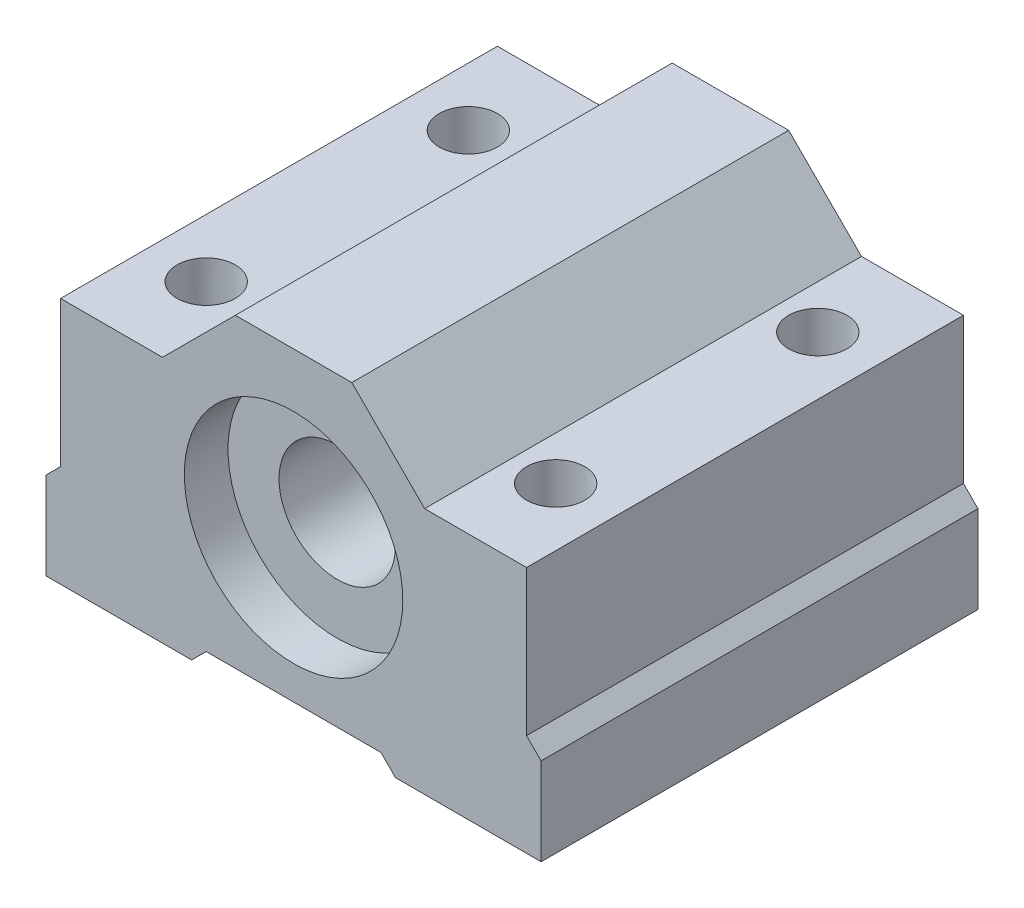
ISO-10303-21;
HEADER;
FILE_DESCRIPTION(('STEP AP214'),'2;1');
FILE_NAME('part.step','',(''),(''),'','','');
FILE_SCHEMA(('AUTOMOTIVE_DESIGN { 1 0 10303 214 1 1 1 1 }'));
ENDSEC;
DATA;
#1=APPLICATION_CONTEXT('core data for automotive mechanical design processes');
#2=APPLICATION_PROTOCOL_DEFINITION('international standard','automotive_design',2000,#1);
#3=PRODUCT_CONTEXT('',#1,'mechanical');
#4=PRODUCT('Part','Part','',(#3));
#5=PRODUCT_RELATED_PRODUCT_CATEGORY('part','',(#4));
#6=PRODUCT_DEFINITION_FORMATION('','',#4);
#7=PRODUCT_DEFINITION_CONTEXT('part definition',#1,'design');
#8=PRODUCT_DEFINITION('design','',#6,#7);
#9=PRODUCT_DEFINITION_SHAPE('','',#8);
#10=(LENGTH_UNIT() NAMED_UNIT(*) SI_UNIT(.MILLI.,.METRE.));
#11=(NAMED_UNIT(*) PLANE_ANGLE_UNIT() SI_UNIT($,.RADIAN.));
#12=(NAMED_UNIT(*) SI_UNIT($,.STERADIAN.) SOLID_ANGLE_UNIT());
#13=UNCERTAINTY_MEASURE_WITH_UNIT(LENGTH_MEASURE(1.E-05),#10,'distance_accuracy_value','');
#14=(GEOMETRIC_REPRESENTATION_CONTEXT(3) GLOBAL_UNCERTAINTY_ASSIGNED_CONTEXT((#13)) GLOBAL_UNIT_ASSIGNED_CONTEXT((#10,
#11,#12)) REPRESENTATION_CONTEXT('',''));
#15=CARTESIAN_POINT('',(0.,0.,0.));
#16=DIRECTION('',(0.,0.,1.));
#17=DIRECTION('',(1.,0.,0.));
#18=AXIS2_PLACEMENT_3D('',#15,#16,#17);
#19=CARTESIAN_POINT('',(-1.89319855181285,-1.89319855181285,-15.));
#20=DIRECTION('',(-0.707106781186548,-0.707106781186547,0.));
#21=DIRECTION('',(0.707106781186547,-0.707106781186548,0.));
#22=AXIS2_PLACEMENT_3D('',#19,#20,#21);
#23=PLANE('',#22);
#24=DIRECTION('',(0.,0.,1.));
#25=VECTOR('',#24,1.);
#26=CARTESIAN_POINT('',(7.,-10.7863971036257,-15.));
#27=LINE('',#26,#25);
#28=CARTESIAN_POINT('',(7.,-10.7863971036257,-15.));
#29=VERTEX_POINT('',#28);
#30=CARTESIAN_POINT('',(7.,-10.7863971036257,15.));
#31=VERTEX_POINT('',#30);
#32=EDGE_CURVE('E182',#29,#31,#27,.T.);
#33=ORIENTED_EDGE('',*,*,#32,.T.);
#34=DIRECTION('',(0.707106781186547,-0.707106781186548,0.));
#35=VECTOR('',#34,1.);
#36=CARTESIAN_POINT('',(-1.89319855181285,-1.89319855181285,15.));
#37=LINE('',#36,#35);
#38=CARTESIAN_POINT('',(6.,-9.78639710362571,15.));
#39=VERTEX_POINT('',#38);
#40=EDGE_CURVE('E185',#39,#31,#37,.T.);
#41=ORIENTED_EDGE('',*,*,#40,.F.);
#42=DIRECTION('',(0.,0.,1.));
#43=VECTOR('',#42,1.);
#44=CARTESIAN_POINT('',(6.,-9.78639710362571,-15.));
#45=LINE('',#44,#43);
#46=CARTESIAN_POINT('',(6.,-9.78639710362571,-15.));
#47=VERTEX_POINT('',#46);
#48=EDGE_CURVE('E11',#47,#39,#45,.T.);
#49=ORIENTED_EDGE('',*,*,#48,.F.);
#50=DIRECTION('',(0.707106781186547,-0.707106781186548,0.));
#51=VECTOR('',#50,1.);
#52=CARTESIAN_POINT('',(-1.89319855181285,-1.89319855181285,-15.));
#53=LINE('',#52,#51);
#54=EDGE_CURVE('E186',#47,#29,#53,.T.);
#55=ORIENTED_EDGE('',*,*,#54,.T.);
#56=EDGE_LOOP('',(#33,#41,#49,#55));
#57=FACE_BOUND('',#56,.T.);
#58=ADVANCED_FACE('F46',(#57),#23,.T.);
#59=CARTESIAN_POINT('',(0.,-9.78639710362571,-15.));
#60=DIRECTION('',(0.,-1.,0.));
#61=DIRECTION('',(0.,0.,-1.));
#62=AXIS2_PLACEMENT_3D('',#59,#60,#61);
#63=PLANE('',#62);
#64=ORIENTED_EDGE('',*,*,#48,.T.);
#65=DIRECTION('',(1.,0.,0.));
#66=VECTOR('',#65,1.);
#67=CARTESIAN_POINT('',(0.,-9.78639710362571,15.));
#68=LINE('',#67,#66);
#69=CARTESIAN_POINT('',(-6.,-9.78639710362571,15.));
#70=VERTEX_POINT('',#69);
#71=EDGE_CURVE('E206',#70,#39,#68,.T.);
#72=ORIENTED_EDGE('',*,*,#71,.F.);
#73=DIRECTION('',(0.,0.,1.));
#74=VECTOR('',#73,1.);
#75=CARTESIAN_POINT('',(-6.,-9.78639710362571,-15.));
#76=LINE('',#75,#74);
#77=CARTESIAN_POINT('',(-6.,-9.78639710362571,-15.));
#78=VERTEX_POINT('',#77);
#79=EDGE_CURVE('E55',#78,#70,#76,.T.);
#80=ORIENTED_EDGE('',*,*,#79,.F.);
#81=DIRECTION('',(1.,0.,0.));
#82=VECTOR('',#81,1.);
#83=CARTESIAN_POINT('',(0.,-9.78639710362571,-15.));
#84=LINE('',#83,#82);
#85=EDGE_CURVE('E192',#78,#47,#84,.T.);
#86=ORIENTED_EDGE('',*,*,#85,.T.);
#87=EDGE_LOOP('',(#64,#72,#80,#86));
#88=FACE_BOUND('',#87,.T.);
#89=ADVANCED_FACE('F414',(#88),#63,.T.);
#90=CARTESIAN_POINT('',(1.89319855181288,-1.8931985518129,-15.));
#91=DIRECTION('',(-0.707106781186544,0.707106781186551,0.));
#92=DIRECTION('',(-0.707106781186551,-0.707106781186544,0.));
#93=AXIS2_PLACEMENT_3D('',#90,#91,#92);
#94=PLANE('',#93);
#95=ORIENTED_EDGE('',*,*,#79,.T.);
#96=DIRECTION('',(-0.707106781186551,-0.707106781186544,0.));
#97=VECTOR('',#96,1.);
#98=CARTESIAN_POINT('',(1.89319855181288,-1.8931985518129,15.));
#99=LINE('',#98,#97);
#100=CARTESIAN_POINT('',(-7.00000000000001,-10.7863971036257,15.));
#101=VERTEX_POINT('',#100);
#102=EDGE_CURVE('E262',#70,#101,#99,.T.);
#103=ORIENTED_EDGE('',*,*,#102,.T.);
#104=DIRECTION('',(0.,0.,1.));
#105=VECTOR('',#104,1.);
#106=CARTESIAN_POINT('',(-7.00000000000001,-10.7863971036257,-15.));
#107=LINE('',#106,#105);
#108=CARTESIAN_POINT('',(-7.00000000000001,-10.7863971036257,-15.));
#109=VERTEX_POINT('',#108);
#110=EDGE_CURVE('E322',#109,#101,#107,.T.);
#111=ORIENTED_EDGE('',*,*,#110,.F.);
#112=DIRECTION('',(-0.707106781186551,-0.707106781186544,0.));
#113=VECTOR('',#112,1.);
#114=CARTESIAN_POINT('',(1.89319855181288,-1.8931985518129,-15.));
#115=LINE('',#114,#113);
#116=EDGE_CURVE('E315',#78,#109,#115,.T.);
#117=ORIENTED_EDGE('',*,*,#116,.F.);
#118=EDGE_LOOP('',(#95,#103,#111,#117));
#119=FACE_BOUND('',#118,.T.);
#120=ADVANCED_FACE('F418',(#119),#94,.F.);
#121=CARTESIAN_POINT('',(0.,-10.7863971036257,-15.));
#122=DIRECTION('',(0.,-1.,0.));
#123=DIRECTION('',(0.,0.,-1.));
#124=AXIS2_PLACEMENT_3D('',#121,#122,#123);
#125=PLANE('',#124);
#126=CARTESIAN_POINT('',(-12.,-10.7863971036257,8.99999999999999));
#127=DIRECTION('',(0.,-1.,0.));
#128=DIRECTION('',(0.,0.,1.));
#129=AXIS2_PLACEMENT_3D('',#126,#127,#128);
#130=CIRCLE('',#129,2.);
#131=CARTESIAN_POINT('',(-12.,-10.7863971036257,11.));
#132=VERTEX_POINT('',#131);
#133=EDGE_CURVE('E490',#132,#132,#130,.T.);
#134=ORIENTED_EDGE('',*,*,#133,.F.);
#135=EDGE_LOOP('',(#134));
#136=FACE_BOUND('',#135,.T.);
#137=CARTESIAN_POINT('',(-12.,-10.7863971036257,-8.99999999999999));
#138=DIRECTION('',(0.,-1.,0.));
#139=DIRECTION('',(0.,0.,-1.));
#140=AXIS2_PLACEMENT_3D('',#137,#138,#139);
#141=CIRCLE('',#140,2.);
#142=CARTESIAN_POINT('',(-12.,-10.7863971036257,-11.));
#143=VERTEX_POINT('',#142);
#144=EDGE_CURVE('E496',#143,#143,#141,.T.);
#145=ORIENTED_EDGE('',*,*,#144,.F.);
#146=EDGE_LOOP('',(#145));
#147=FACE_BOUND('',#146,.T.);
#148=ORIENTED_EDGE('',*,*,#110,.T.);
#149=DIRECTION('',(1.,0.,0.));
#150=VECTOR('',#149,1.);
#151=CARTESIAN_POINT('',(0.,-10.7863971036257,15.));
#152=LINE('',#151,#150);
#153=CARTESIAN_POINT('',(-17.,-10.7863971036257,15.));
#154=VERTEX_POINT('',#153);
#155=EDGE_CURVE('E258',#154,#101,#152,.T.);
#156=ORIENTED_EDGE('',*,*,#155,.F.);
#157=DIRECTION('',(0.,0.,1.));
#158=VECTOR('',#157,1.);
#159=CARTESIAN_POINT('',(-17.,-10.7863971036257,-15.));
#160=LINE('',#159,#158);
#161=CARTESIAN_POINT('',(-17.,-10.7863971036257,-15.));
#162=VERTEX_POINT('',#161);
#163=EDGE_CURVE('E325',#162,#154,#160,.T.);
#164=ORIENTED_EDGE('',*,*,#163,.F.);
#165=DIRECTION('',(1.,0.,0.));
#166=VECTOR('',#165,1.);
#167=CARTESIAN_POINT('',(0.,-10.7863971036257,-15.));
#168=LINE('',#167,#166);
#169=EDGE_CURVE('E311',#162,#109,#168,.T.);
#170=ORIENTED_EDGE('',*,*,#169,.T.);
#171=EDGE_LOOP('',(#148,#156,#164,#170));
#172=FACE_BOUND('',#171,.T.);
#173=ADVANCED_FACE('F423',(#136,#147,#172),#125,.T.);
#174=CARTESIAN_POINT('',(-17.,0.,-15.));
#175=DIRECTION('',(1.,0.,0.));
#176=DIRECTION('',(0.,0.,-1.));
#177=AXIS2_PLACEMENT_3D('',#174,#175,#176);
#178=PLANE('',#177);
#179=ORIENTED_EDGE('',*,*,#163,.T.);
#180=DIRECTION('',(0.,1.,0.));
#181=VECTOR('',#180,1.);
#182=CARTESIAN_POINT('',(-17.,0.,15.));
#183=LINE('',#182,#181);
#184=CARTESIAN_POINT('',(-17.,-4.7863971036257,15.));
#185=VERTEX_POINT('',#184);
#186=EDGE_CURVE('E254',#154,#185,#183,.T.);
#187=ORIENTED_EDGE('',*,*,#186,.T.);
#188=DIRECTION('',(0.,0.,1.));
#189=VECTOR('',#188,1.);
#190=CARTESIAN_POINT('',(-17.,-4.7863971036257,-15.));
#191=LINE('',#190,#189);
#192=CARTESIAN_POINT('',(-17.,-4.7863971036257,-15.));
#193=VERTEX_POINT('',#192);
#194=EDGE_CURVE('E328',#193,#185,#191,.T.);
#195=ORIENTED_EDGE('',*,*,#194,.F.);
#196=DIRECTION('',(0.,1.,0.));
#197=VECTOR('',#196,1.);
#198=CARTESIAN_POINT('',(-17.,0.,-15.));
#199=LINE('',#198,#197);
#200=EDGE_CURVE('E308',#162,#193,#199,.T.);
#201=ORIENTED_EDGE('',*,*,#200,.F.);
#202=EDGE_LOOP('',(#179,#187,#195,#201));
#203=FACE_BOUND('',#202,.T.);
#204=ADVANCED_FACE('F432',(#203),#178,.F.);
#205=CARTESIAN_POINT('',(-6.10680144818711,6.10680144818714,-15.));
#206=DIRECTION('',(0.707106781186546,-0.707106781186549,0.));
#207=DIRECTION('',(0.707106781186549,0.707106781186546,0.));
#208=AXIS2_PLACEMENT_3D('',#205,#206,#207);
#209=PLANE('',#208);
#210=ORIENTED_EDGE('',*,*,#194,.T.);
#211=DIRECTION('',(0.707106781186549,0.707106781186546,0.));
#212=VECTOR('',#211,1.);
#213=CARTESIAN_POINT('',(-6.10680144818711,6.10680144818714,15.));
#214=LINE('',#213,#212);
#215=CARTESIAN_POINT('',(-16.,-3.78639710362571,15.));
#216=VERTEX_POINT('',#215);
#217=EDGE_CURVE('E250',#185,#216,#214,.T.);
#218=ORIENTED_EDGE('',*,*,#217,.T.);
#219=DIRECTION('',(0.,0.,1.));
#220=VECTOR('',#219,1.);
#221=CARTESIAN_POINT('',(-16.,-3.78639710362571,-15.));
#222=LINE('',#221,#220);
#223=CARTESIAN_POINT('',(-16.,-3.78639710362571,-15.));
#224=VERTEX_POINT('',#223);
#225=EDGE_CURVE('E331',#224,#216,#222,.T.);
#226=ORIENTED_EDGE('',*,*,#225,.F.);
#227=DIRECTION('',(0.707106781186549,0.707106781186546,0.));
#228=VECTOR('',#227,1.);
#229=CARTESIAN_POINT('',(-6.10680144818711,6.10680144818714,-15.));
#230=LINE('',#229,#228);
#231=EDGE_CURVE('E305',#193,#224,#230,.T.);
#232=ORIENTED_EDGE('',*,*,#231,.F.);
#233=EDGE_LOOP('',(#210,#218,#226,#232));
#234=FACE_BOUND('',#233,.T.);
#235=ADVANCED_FACE('F436',(#234),#209,.F.);
#236=CARTESIAN_POINT('',(-16.,0.,-15.));
#237=DIRECTION('',(1.,0.,0.));
#238=DIRECTION('',(0.,0.,-1.));
#239=AXIS2_PLACEMENT_3D('',#236,#237,#238);
#240=PLANE('',#239);
#241=ORIENTED_EDGE('',*,*,#225,.T.);
#242=DIRECTION('',(0.,1.,0.));
#243=VECTOR('',#242,1.);
#244=CARTESIAN_POINT('',(-16.,0.,15.));
#245=LINE('',#244,#243);
#246=CARTESIAN_POINT('',(-16.,6.21360289637429,15.));
#247=VERTEX_POINT('',#246);
#248=EDGE_CURVE('E246',#216,#247,#245,.T.);
#249=ORIENTED_EDGE('',*,*,#248,.T.);
#250=DIRECTION('',(0.,0.,1.));
#251=VECTOR('',#250,1.);
#252=CARTESIAN_POINT('',(-16.,6.21360289637429,-15.));
#253=LINE('',#252,#251);
#254=CARTESIAN_POINT('',(-16.,6.21360289637429,-15.));
#255=VERTEX_POINT('',#254);
#256=EDGE_CURVE('E334',#255,#247,#253,.T.);
#257=ORIENTED_EDGE('',*,*,#256,.F.);
#258=DIRECTION('',(0.,1.,0.));
#259=VECTOR('',#258,1.);
#260=CARTESIAN_POINT('',(-16.,0.,-15.));
#261=LINE('',#260,#259);
#262=EDGE_CURVE('E302',#224,#255,#261,.T.);
#263=ORIENTED_EDGE('',*,*,#262,.F.);
#264=EDGE_LOOP('',(#241,#249,#257,#263));
#265=FACE_BOUND('',#264,.T.);
#266=ADVANCED_FACE('F440',(#265),#240,.F.);
#267=CARTESIAN_POINT('',(0.,6.21360289637429,-15.));
#268=DIRECTION('',(0.,-1.,0.));
#269=DIRECTION('',(1.,0.,0.));
#270=AXIS2_PLACEMENT_3D('',#267,#268,#269);
#271=PLANE('',#270);
#272=CARTESIAN_POINT('',(-12.,6.21360289637429,8.99999999999999));
#273=DIRECTION('',(0.,-1.,0.));
#274=DIRECTION('',(1.,0.,0.));
#275=AXIS2_PLACEMENT_3D('',#272,#273,#274);
#276=CIRCLE('',#275,2.);
#277=CARTESIAN_POINT('',(-10.,6.21360289637429,8.99999999999999));
#278=VERTEX_POINT('',#277);
#279=EDGE_CURVE('E49',#278,#278,#276,.T.);
#280=ORIENTED_EDGE('',*,*,#279,.T.);
#281=EDGE_LOOP('',(#280));
#282=FACE_BOUND('',#281,.T.);
#283=CARTESIAN_POINT('',(-12.,6.21360289637429,-8.99999999999999));
#284=DIRECTION('',(0.,-1.,0.));
#285=DIRECTION('',(1.,0.,0.));
#286=AXIS2_PLACEMENT_3D('',#283,#284,#285);
#287=CIRCLE('',#286,2.);
#288=CARTESIAN_POINT('',(-9.99999999999999,6.21360289637429,-8.99999999999999));
#289=VERTEX_POINT('',#288);
#290=EDGE_CURVE('E365',#289,#289,#287,.T.);
#291=ORIENTED_EDGE('',*,*,#290,.T.);
#292=EDGE_LOOP('',(#291));
#293=FACE_BOUND('',#292,.T.);
#294=ORIENTED_EDGE('',*,*,#256,.T.);
#295=DIRECTION('',(1.,0.,0.));
#296=VECTOR('',#295,1.);
#297=CARTESIAN_POINT('',(0.,6.21360289637429,15.));
#298=LINE('',#297,#296);
#299=CARTESIAN_POINT('',(-9.,6.21360289637429,15.));
#300=VERTEX_POINT('',#299);
#301=EDGE_CURVE('E242',#247,#300,#298,.T.);
#302=ORIENTED_EDGE('',*,*,#301,.T.);
#303=DIRECTION('',(0.,0.,1.));
#304=VECTOR('',#303,1.);
#305=CARTESIAN_POINT('',(-9.,6.21360289637429,-15.));
#306=LINE('',#305,#304);
#307=CARTESIAN_POINT('',(-9.,6.21360289637429,-15.));
#308=VERTEX_POINT('',#307);
#309=EDGE_CURVE('E337',#308,#300,#306,.T.);
#310=ORIENTED_EDGE('',*,*,#309,.F.);
#311=DIRECTION('',(1.,0.,0.));
#312=VECTOR('',#311,1.);
#313=CARTESIAN_POINT('',(0.,6.21360289637429,-15.));
#314=LINE('',#313,#312);
#315=EDGE_CURVE('E299',#255,#308,#314,.T.);
#316=ORIENTED_EDGE('',*,*,#315,.F.);
#317=EDGE_LOOP('',(#294,#302,#310,#316));
#318=FACE_BOUND('',#317,.T.);
#319=ADVANCED_FACE('F444',(#282,#293,#318),#271,.F.);
#320=CARTESIAN_POINT('',(-7.60680144818716,7.60680144818714,-15.));
#321=DIRECTION('',(0.707106781186549,-0.707106781186547,0.));
#322=DIRECTION('',(0.707106781186547,0.707106781186549,0.));
#323=AXIS2_PLACEMENT_3D('',#320,#321,#322);
#324=PLANE('',#323);
#325=ORIENTED_EDGE('',*,*,#309,.T.);
#326=DIRECTION('',(0.707106781186547,0.707106781186549,0.));
#327=VECTOR('',#326,1.);
#328=CARTESIAN_POINT('',(-7.60680144818716,7.60680144818714,15.));
#329=LINE('',#328,#327);
#330=CARTESIAN_POINT('',(-4.00000000000002,11.2136028963743,15.));
#331=VERTEX_POINT('',#330);
#332=EDGE_CURVE('E238',#300,#331,#329,.T.);
#333=ORIENTED_EDGE('',*,*,#332,.T.);
#334=DIRECTION('',(0.,0.,1.));
#335=VECTOR('',#334,1.);
#336=CARTESIAN_POINT('',(-4.00000000000002,11.2136028963743,-15.));
#337=LINE('',#336,#335);
#338=CARTESIAN_POINT('',(-4.00000000000002,11.2136028963743,-15.));
#339=VERTEX_POINT('',#338);
#340=EDGE_CURVE('E340',#339,#331,#337,.T.);
#341=ORIENTED_EDGE('',*,*,#340,.F.);
#342=DIRECTION('',(0.707106781186547,0.707106781186549,0.));
#343=VECTOR('',#342,1.);
#344=CARTESIAN_POINT('',(-7.60680144818716,7.60680144818714,-15.));
#345=LINE('',#344,#343);
#346=EDGE_CURVE('E296',#308,#339,#345,.T.);
#347=ORIENTED_EDGE('',*,*,#346,.F.);
#348=EDGE_LOOP('',(#325,#333,#341,#347));
#349=FACE_BOUND('',#348,.T.);
#350=ADVANCED_FACE('F448',(#349),#324,.F.);
#351=CARTESIAN_POINT('',(0.,11.2136028963743,-15.));
#352=DIRECTION('',(0.,-1.,0.));
#353=DIRECTION('',(1.,0.,0.));
#354=AXIS2_PLACEMENT_3D('',#351,#352,#353);
#355=PLANE('',#354);
#356=ORIENTED_EDGE('',*,*,#340,.T.);
#357=DIRECTION('',(1.,0.,0.));
#358=VECTOR('',#357,1.);
#359=CARTESIAN_POINT('',(0.,11.2136028963743,15.));
#360=LINE('',#359,#358);
#361=CARTESIAN_POINT('',(4.00000000000003,11.2136028963743,15.));
#362=VERTEX_POINT('',#361);
#363=EDGE_CURVE('E234',#331,#362,#360,.T.);
#364=ORIENTED_EDGE('',*,*,#363,.T.);
#365=DIRECTION('',(0.,0.,1.));
#366=VECTOR('',#365,1.);
#367=CARTESIAN_POINT('',(4.00000000000003,11.2136028963743,-15.));
#368=LINE('',#367,#366);
#369=CARTESIAN_POINT('',(4.00000000000003,11.2136028963743,-15.));
#370=VERTEX_POINT('',#369);
#371=EDGE_CURVE('E343',#370,#362,#368,.T.);
#372=ORIENTED_EDGE('',*,*,#371,.F.);
#373=DIRECTION('',(1.,0.,0.));
#374=VECTOR('',#373,1.);
#375=CARTESIAN_POINT('',(0.,11.2136028963743,-15.));
#376=LINE('',#375,#374);
#377=EDGE_CURVE('E293',#339,#370,#376,.T.);
#378=ORIENTED_EDGE('',*,*,#377,.F.);
#379=EDGE_LOOP('',(#356,#364,#372,#378));
#380=FACE_BOUND('',#379,.T.);
#381=ADVANCED_FACE('F452',(#380),#355,.F.);
#382=CARTESIAN_POINT('',(7.60680144818716,7.60680144818714,-15.));
#383=DIRECTION('',(0.707106781186549,0.707106781186546,0.));
#384=DIRECTION('',(-0.707106781186546,0.707106781186549,0.));
#385=AXIS2_PLACEMENT_3D('',#382,#383,#384);
#386=PLANE('',#385);
#387=ORIENTED_EDGE('',*,*,#371,.T.);
#388=DIRECTION('',(-0.707106781186546,0.707106781186549,0.));
#389=VECTOR('',#388,1.);
#390=CARTESIAN_POINT('',(7.60680144818716,7.60680144818714,15.));
#391=LINE('',#390,#389);
#392=CARTESIAN_POINT('',(9.,6.21360289637429,15.));
#393=VERTEX_POINT('',#392);
#394=EDGE_CURVE('E230',#393,#362,#391,.T.);
#395=ORIENTED_EDGE('',*,*,#394,.F.);
#396=DIRECTION('',(0.,0.,1.));
#397=VECTOR('',#396,1.);
#398=CARTESIAN_POINT('',(9.,6.21360289637429,-15.));
#399=LINE('',#398,#397);
#400=CARTESIAN_POINT('',(9.,6.21360289637429,-15.));
#401=VERTEX_POINT('',#400);
#402=EDGE_CURVE('E346',#401,#393,#399,.T.);
#403=ORIENTED_EDGE('',*,*,#402,.F.);
#404=DIRECTION('',(-0.707106781186546,0.707106781186549,0.));
#405=VECTOR('',#404,1.);
#406=CARTESIAN_POINT('',(7.60680144818716,7.60680144818714,-15.));
#407=LINE('',#406,#405);
#408=EDGE_CURVE('E289',#401,#370,#407,.T.);
#409=ORIENTED_EDGE('',*,*,#408,.T.);
#410=EDGE_LOOP('',(#387,#395,#403,#409));
#411=FACE_BOUND('',#410,.T.);
#412=ADVANCED_FACE('F456',(#411),#386,.T.);
#413=CARTESIAN_POINT('',(0.,6.21360289637429,-15.));
#414=DIRECTION('',(0.,1.,0.));
#415=DIRECTION('',(-1.,0.,0.));
#416=AXIS2_PLACEMENT_3D('',#413,#414,#415);
#417=PLANE('',#416);
#418=CARTESIAN_POINT('',(12.,6.21360289637429,-9.));
#419=DIRECTION('',(0.,1.,0.));
#420=DIRECTION('',(-1.,0.,0.));
#421=AXIS2_PLACEMENT_3D('',#418,#419,#420);
#422=CIRCLE('',#421,2.);
#423=CARTESIAN_POINT('',(10.,6.21360289637429,-9.));
#424=VERTEX_POINT('',#423);
#425=EDGE_CURVE('E368',#424,#424,#422,.T.);
#426=ORIENTED_EDGE('',*,*,#425,.F.);
#427=EDGE_LOOP('',(#426));
#428=FACE_BOUND('',#427,.T.);
#429=CARTESIAN_POINT('',(12.,6.21360289637429,9.));
#430=DIRECTION('',(0.,1.,0.));
#431=DIRECTION('',(-1.,0.,0.));
#432=AXIS2_PLACEMENT_3D('',#429,#430,#431);
#433=CIRCLE('',#432,2.);
#434=CARTESIAN_POINT('',(10.,6.21360289637429,9.));
#435=VERTEX_POINT('',#434);
#436=EDGE_CURVE('E375',#435,#435,#433,.T.);
#437=ORIENTED_EDGE('',*,*,#436,.F.);
#438=EDGE_LOOP('',(#437));
#439=FACE_BOUND('',#438,.T.);
#440=ORIENTED_EDGE('',*,*,#402,.T.);
#441=DIRECTION('',(-1.,0.,0.));
#442=VECTOR('',#441,1.);
#443=CARTESIAN_POINT('',(0.,6.21360289637429,15.));
#444=LINE('',#443,#442);
#445=CARTESIAN_POINT('',(16.,6.21360289637429,15.));
#446=VERTEX_POINT('',#445);
#447=EDGE_CURVE('E226',#446,#393,#444,.T.);
#448=ORIENTED_EDGE('',*,*,#447,.F.);
#449=DIRECTION('',(0.,0.,1.));
#450=VECTOR('',#449,1.);
#451=CARTESIAN_POINT('',(16.,6.21360289637429,-15.));
#452=LINE('',#451,#450);
#453=CARTESIAN_POINT('',(16.,6.21360289637429,-15.));
#454=VERTEX_POINT('',#453);
#455=EDGE_CURVE('E349',#454,#446,#452,.T.);
#456=ORIENTED_EDGE('',*,*,#455,.F.);
#457=DIRECTION('',(-1.,0.,0.));
#458=VECTOR('',#457,1.);
#459=CARTESIAN_POINT('',(0.,6.21360289637429,-15.));
#460=LINE('',#459,#458);
#461=EDGE_CURVE('E285',#454,#401,#460,.T.);
#462=ORIENTED_EDGE('',*,*,#461,.T.);
#463=EDGE_LOOP('',(#440,#448,#456,#462));
#464=FACE_BOUND('',#463,.T.);
#465=ADVANCED_FACE('F460',(#428,#439,#464),#417,.T.);
#466=CARTESIAN_POINT('',(16.,0.,-15.));
#467=DIRECTION('',(1.,0.,0.));
#468=DIRECTION('',(0.,0.,-1.));
#469=AXIS2_PLACEMENT_3D('',#466,#467,#468);
#470=PLANE('',#469);
#471=ORIENTED_EDGE('',*,*,#455,.T.);
#472=DIRECTION('',(0.,1.,0.));
#473=VECTOR('',#472,1.);
#474=CARTESIAN_POINT('',(16.,0.,15.));
#475=LINE('',#474,#473);
#476=CARTESIAN_POINT('',(16.,-3.78639710362571,15.));
#477=VERTEX_POINT('',#476);
#478=EDGE_CURVE('E222',#477,#446,#475,.T.);
#479=ORIENTED_EDGE('',*,*,#478,.F.);
#480=DIRECTION('',(0.,0.,1.));
#481=VECTOR('',#480,1.);
#482=CARTESIAN_POINT('',(16.,-3.78639710362571,-15.));
#483=LINE('',#482,#481);
#484=CARTESIAN_POINT('',(16.,-3.78639710362571,-15.));
#485=VERTEX_POINT('',#484);
#486=EDGE_CURVE('E352',#485,#477,#483,.T.);
#487=ORIENTED_EDGE('',*,*,#486,.F.);
#488=DIRECTION('',(0.,1.,0.));
#489=VECTOR('',#488,1.);
#490=CARTESIAN_POINT('',(16.,0.,-15.));
#491=LINE('',#490,#489);
#492=EDGE_CURVE('E281',#485,#454,#491,.T.);
#493=ORIENTED_EDGE('',*,*,#492,.T.);
#494=EDGE_LOOP('',(#471,#479,#487,#493));
#495=FACE_BOUND('',#494,.T.);
#496=ADVANCED_FACE('F464',(#495),#470,.T.);
#497=CARTESIAN_POINT('',(6.10680144818711,6.10680144818714,-15.));
#498=DIRECTION('',(0.707106781186546,0.707106781186549,0.));
#499=DIRECTION('',(-0.707106781186549,0.707106781186546,0.));
#500=AXIS2_PLACEMENT_3D('',#497,#498,#499);
#501=PLANE('',#500);
#502=ORIENTED_EDGE('',*,*,#486,.T.);
#503=DIRECTION('',(-0.707106781186549,0.707106781186546,0.));
#504=VECTOR('',#503,1.);
#505=CARTESIAN_POINT('',(6.10680144818711,6.10680144818714,15.));
#506=LINE('',#505,#504);
#507=CARTESIAN_POINT('',(17.,-4.7863971036257,15.));
#508=VERTEX_POINT('',#507);
#509=EDGE_CURVE('E218',#508,#477,#506,.T.);
#510=ORIENTED_EDGE('',*,*,#509,.F.);
#511=DIRECTION('',(0.,0.,1.));
#512=VECTOR('',#511,1.);
#513=CARTESIAN_POINT('',(17.,-4.7863971036257,-15.));
#514=LINE('',#513,#512);
#515=CARTESIAN_POINT('',(17.,-4.7863971036257,-15.));
#516=VERTEX_POINT('',#515);
#517=EDGE_CURVE('E355',#516,#508,#514,.T.);
#518=ORIENTED_EDGE('',*,*,#517,.F.);
#519=DIRECTION('',(-0.707106781186549,0.707106781186546,0.));
#520=VECTOR('',#519,1.);
#521=CARTESIAN_POINT('',(6.10680144818711,6.10680144818714,-15.));
#522=LINE('',#521,#520);
#523=EDGE_CURVE('E277',#516,#485,#522,.T.);
#524=ORIENTED_EDGE('',*,*,#523,.T.);
#525=EDGE_LOOP('',(#502,#510,#518,#524));
#526=FACE_BOUND('',#525,.T.);
#527=ADVANCED_FACE('F468',(#526),#501,.T.);
#528=CARTESIAN_POINT('',(17.,0.,-15.));
#529=DIRECTION('',(1.,0.,0.));
#530=DIRECTION('',(0.,0.,-1.));
#531=AXIS2_PLACEMENT_3D('',#528,#529,#530);
#532=PLANE('',#531);
#533=ORIENTED_EDGE('',*,*,#517,.T.);
#534=DIRECTION('',(0.,1.,0.));
#535=VECTOR('',#534,1.);
#536=CARTESIAN_POINT('',(17.,0.,15.));
#537=LINE('',#536,#535);
#538=CARTESIAN_POINT('',(17.,-10.7863971036257,15.));
#539=VERTEX_POINT('',#538);
#540=EDGE_CURVE('E201',#539,#508,#537,.T.);
#541=ORIENTED_EDGE('',*,*,#540,.F.);
#542=DIRECTION('',(0.,0.,1.));
#543=VECTOR('',#542,1.);
#544=CARTESIAN_POINT('',(17.,-10.7863971036257,-15.));
#545=LINE('',#544,#543);
#546=CARTESIAN_POINT('',(17.,-10.7863971036257,-15.));
#547=VERTEX_POINT('',#546);
#548=EDGE_CURVE('E191',#547,#539,#545,.T.);
#549=ORIENTED_EDGE('',*,*,#548,.F.);
#550=DIRECTION('',(0.,1.,0.));
#551=VECTOR('',#550,1.);
#552=CARTESIAN_POINT('',(17.,0.,-15.));
#553=LINE('',#552,#551);
#554=EDGE_CURVE('E273',#547,#516,#553,.T.);
#555=ORIENTED_EDGE('',*,*,#554,.T.);
#556=EDGE_LOOP('',(#533,#541,#549,#555));
#557=FACE_BOUND('',#556,.T.);
#558=ADVANCED_FACE('F472',(#557),#532,.T.);
#559=CARTESIAN_POINT('',(0.,-10.7863971036257,-15.));
#560=DIRECTION('',(0.,-1.,0.));
#561=DIRECTION('',(0.,0.,-1.));
#562=AXIS2_PLACEMENT_3D('',#559,#560,#561);
#563=PLANE('',#562);
#564=CARTESIAN_POINT('',(12.,-10.7863971036257,-9.));
#565=DIRECTION('',(0.,-1.,0.));
#566=DIRECTION('',(0.,0.,1.));
#567=AXIS2_PLACEMENT_3D('',#564,#565,#566);
#568=CIRCLE('',#567,2.);
#569=CARTESIAN_POINT('',(12.,-10.7863971036257,-7.));
#570=VERTEX_POINT('',#569);
#571=EDGE_CURVE('E485',#570,#570,#568,.T.);
#572=ORIENTED_EDGE('',*,*,#571,.F.);
#573=EDGE_LOOP('',(#572));
#574=FACE_BOUND('',#573,.T.);
#575=CARTESIAN_POINT('',(12.,-10.7863971036257,9.));
#576=DIRECTION('',(0.,-1.,0.));
#577=DIRECTION('',(0.,0.,-1.));
#578=AXIS2_PLACEMENT_3D('',#575,#576,#577);
#579=CIRCLE('',#578,2.);
#580=CARTESIAN_POINT('',(12.,-10.7863971036257,7.));
#581=VERTEX_POINT('',#580);
#582=EDGE_CURVE('E381',#581,#581,#579,.T.);
#583=ORIENTED_EDGE('',*,*,#582,.F.);
#584=EDGE_LOOP('',(#583));
#585=FACE_BOUND('',#584,.T.);
#586=ORIENTED_EDGE('',*,*,#548,.T.);
#587=DIRECTION('',(1.,0.,0.));
#588=VECTOR('',#587,1.);
#589=CARTESIAN_POINT('',(0.,-10.7863971036257,15.));
#590=LINE('',#589,#588);
#591=EDGE_CURVE('E195',#31,#539,#590,.T.);
#592=ORIENTED_EDGE('',*,*,#591,.F.);
#593=ORIENTED_EDGE('',*,*,#32,.F.);
#594=DIRECTION('',(1.,0.,0.));
#595=VECTOR('',#594,1.);
#596=CARTESIAN_POINT('',(0.,-10.7863971036257,-15.));
#597=LINE('',#596,#595);
#598=EDGE_CURVE('E270',#29,#547,#597,.T.);
#599=ORIENTED_EDGE('',*,*,#598,.T.);
#600=EDGE_LOOP('',(#586,#592,#593,#599));
#601=FACE_BOUND('',#600,.T.);
#602=ADVANCED_FACE('F196',(#574,#585,#601),#563,.T.);
#603=CARTESIAN_POINT('',(0.,0.,-15.));
#604=DIRECTION('',(0.,0.,1.));
#605=DIRECTION('',(1.,0.,0.));
#606=AXIS2_PLACEMENT_3D('',#603,#604,#605);
#607=PLANE('',#606);
#608=CARTESIAN_POINT('',(0.,0.,-15.));
#609=DIRECTION('',(0.,0.,1.));
#610=DIRECTION('',(1.,0.,0.));
#611=AXIS2_PLACEMENT_3D('',#608,#609,#610);
#612=CIRCLE('',#611,7.5);
#613=CARTESIAN_POINT('',(7.5,0.,-15.));
#614=VERTEX_POINT('',#613);
#615=EDGE_CURVE('E208',#614,#614,#612,.T.);
#616=ORIENTED_EDGE('',*,*,#615,.T.);
#617=EDGE_LOOP('',(#616));
#618=FACE_BOUND('',#617,.T.);
#619=ORIENTED_EDGE('',*,*,#54,.F.);
#620=ORIENTED_EDGE('',*,*,#85,.F.);
#621=ORIENTED_EDGE('',*,*,#116,.T.);
#622=ORIENTED_EDGE('',*,*,#169,.F.);
#623=ORIENTED_EDGE('',*,*,#200,.T.);
#624=ORIENTED_EDGE('',*,*,#231,.T.);
#625=ORIENTED_EDGE('',*,*,#262,.T.);
#626=ORIENTED_EDGE('',*,*,#315,.T.);
#627=ORIENTED_EDGE('',*,*,#346,.T.);
#628=ORIENTED_EDGE('',*,*,#377,.T.);
#629=ORIENTED_EDGE('',*,*,#408,.F.);
#630=ORIENTED_EDGE('',*,*,#461,.F.);
#631=ORIENTED_EDGE('',*,*,#492,.F.);
#632=ORIENTED_EDGE('',*,*,#523,.F.);
#633=ORIENTED_EDGE('',*,*,#554,.F.);
#634=ORIENTED_EDGE('',*,*,#598,.F.);
#635=EDGE_LOOP('',(#619,#620,#621,#622,#623,#624,#625,#626,#627,#628,#629,#630,#631,#632,#633,#634));
#636=FACE_BOUND('',#635,.T.);
#637=ADVANCED_FACE('F427',(#618,#636),#607,.F.);
#638=CARTESIAN_POINT('',(0.,0.,15.));
#639=DIRECTION('',(0.,0.,1.));
#640=DIRECTION('',(1.,0.,0.));
#641=AXIS2_PLACEMENT_3D('',#638,#639,#640);
#642=PLANE('',#641);
#643=CARTESIAN_POINT('',(0.,0.,15.));
#644=DIRECTION('',(0.,0.,1.));
#645=DIRECTION('',(1.,0.,0.));
#646=AXIS2_PLACEMENT_3D('',#643,#644,#645);
#647=CIRCLE('',#646,7.5);
#648=CARTESIAN_POINT('',(7.5,0.,15.));
#649=VERTEX_POINT('',#648);
#650=EDGE_CURVE('E388',#649,#649,#647,.T.);
#651=ORIENTED_EDGE('',*,*,#650,.F.);
#652=EDGE_LOOP('',(#651));
#653=FACE_BOUND('',#652,.T.);
#654=ORIENTED_EDGE('',*,*,#40,.T.);
#655=ORIENTED_EDGE('',*,*,#591,.T.);
#656=ORIENTED_EDGE('',*,*,#540,.T.);
#657=ORIENTED_EDGE('',*,*,#509,.T.);
#658=ORIENTED_EDGE('',*,*,#478,.T.);
#659=ORIENTED_EDGE('',*,*,#447,.T.);
#660=ORIENTED_EDGE('',*,*,#394,.T.);
#661=ORIENTED_EDGE('',*,*,#363,.F.);
#662=ORIENTED_EDGE('',*,*,#332,.F.);
#663=ORIENTED_EDGE('',*,*,#301,.F.);
#664=ORIENTED_EDGE('',*,*,#248,.F.);
#665=ORIENTED_EDGE('',*,*,#217,.F.);
#666=ORIENTED_EDGE('',*,*,#186,.F.);
#667=ORIENTED_EDGE('',*,*,#155,.T.);
#668=ORIENTED_EDGE('',*,*,#102,.F.);
#669=ORIENTED_EDGE('',*,*,#71,.T.);
#670=EDGE_LOOP('',(#654,#655,#656,#657,#658,#659,#660,#661,#662,#663,#664,#665,#666,#667,#668,#669));
#671=FACE_BOUND('',#670,.T.);
#672=ADVANCED_FACE('F204',(#653,#671),#642,.T.);
#673=CARTESIAN_POINT('',(0.,0.,-15.));
#674=DIRECTION('',(0.,0.,1.));
#675=DIRECTION('',(1.,0.,0.));
#676=AXIS2_PLACEMENT_3D('',#673,#674,#675);
#677=CYLINDRICAL_SURFACE('',#676,7.5);
#678=ORIENTED_EDGE('',*,*,#615,.F.);
#679=EDGE_LOOP('',(#678));
#680=FACE_BOUND('',#679,.T.);
#681=CARTESIAN_POINT('',(0.,0.,-12.));
#682=DIRECTION('',(0.,0.,1.));
#683=DIRECTION('',(1.,0.,0.));
#684=AXIS2_PLACEMENT_3D('',#681,#682,#683);
#685=CIRCLE('',#684,7.5);
#686=CARTESIAN_POINT('',(7.5,0.,-12.));
#687=VERTEX_POINT('',#686);
#688=EDGE_CURVE('E212',#687,#687,#685,.T.);
#689=ORIENTED_EDGE('',*,*,#688,.T.);
#690=EDGE_LOOP('',(#689));
#691=FACE_BOUND('',#690,.T.);
#692=ADVANCED_FACE('F410',(#680,#691),#677,.F.);
#693=CARTESIAN_POINT('',(0.,0.,-12.));
#694=DIRECTION('',(0.,0.,1.));
#695=DIRECTION('',(1.,0.,0.));
#696=AXIS2_PLACEMENT_3D('',#693,#694,#695);
#697=PLANE('',#696);
#698=CARTESIAN_POINT('',(0.,0.,-12.));
#699=DIRECTION('',(0.,0.,1.));
#700=DIRECTION('',(1.,0.,0.));
#701=AXIS2_PLACEMENT_3D('',#698,#699,#700);
#702=CIRCLE('',#701,4.);
#703=CARTESIAN_POINT('',(4.,0.,-12.));
#704=VERTEX_POINT('',#703);
#705=EDGE_CURVE('E360',#704,#704,#702,.T.);
#706=ORIENTED_EDGE('',*,*,#705,.T.);
#707=EDGE_LOOP('',(#706));
#708=FACE_BOUND('',#707,.T.);
#709=ORIENTED_EDGE('',*,*,#688,.F.);
#710=EDGE_LOOP('',(#709));
#711=FACE_BOUND('',#710,.T.);
#712=ADVANCED_FACE('F400',(#708,#711),#697,.F.);
#713=CARTESIAN_POINT('',(0.,0.,15.));
#714=DIRECTION('',(0.,0.,-1.));
#715=DIRECTION('',(-1.,0.,0.));
#716=AXIS2_PLACEMENT_3D('',#713,#714,#715);
#717=CYLINDRICAL_SURFACE('',#716,7.5);
#718=ORIENTED_EDGE('',*,*,#650,.T.);
#719=EDGE_LOOP('',(#718));
#720=FACE_BOUND('',#719,.T.);
#721=CARTESIAN_POINT('',(0.,0.,12.));
#722=DIRECTION('',(0.,0.,1.));
#723=DIRECTION('',(1.,0.,0.));
#724=AXIS2_PLACEMENT_3D('',#721,#722,#723);
#725=CIRCLE('',#724,7.5);
#726=CARTESIAN_POINT('',(7.5,0.,12.));
#727=VERTEX_POINT('',#726);
#728=EDGE_CURVE('E363',#727,#727,#725,.T.);
#729=ORIENTED_EDGE('',*,*,#728,.F.);
#730=EDGE_LOOP('',(#729));
#731=FACE_BOUND('',#730,.T.);
#732=ADVANCED_FACE('F398',(#720,#731),#717,.F.);
#733=CARTESIAN_POINT('',(0.,0.,12.));
#734=DIRECTION('',(0.,0.,-1.));
#735=DIRECTION('',(1.,0.,0.));
#736=AXIS2_PLACEMENT_3D('',#733,#734,#735);
#737=PLANE('',#736);
#738=CARTESIAN_POINT('',(0.,0.,12.));
#739=DIRECTION('',(0.,0.,1.));
#740=DIRECTION('',(1.,0.,0.));
#741=AXIS2_PLACEMENT_3D('',#738,#739,#740);
#742=CIRCLE('',#741,4.);
#743=CARTESIAN_POINT('',(4.,0.,12.));
#744=VERTEX_POINT('',#743);
#745=EDGE_CURVE('E364',#744,#744,#742,.T.);
#746=ORIENTED_EDGE('',*,*,#745,.F.);
#747=EDGE_LOOP('',(#746));
#748=FACE_BOUND('',#747,.T.);
#749=ORIENTED_EDGE('',*,*,#728,.T.);
#750=EDGE_LOOP('',(#749));
#751=FACE_BOUND('',#750,.T.);
#752=ADVANCED_FACE('F396',(#748,#751),#737,.F.);
#753=CARTESIAN_POINT('',(0.,0.,-15.));
#754=DIRECTION('',(0.,0.,1.));
#755=DIRECTION('',(1.,0.,0.));
#756=AXIS2_PLACEMENT_3D('',#753,#754,#755);
#757=CYLINDRICAL_SURFACE('',#756,4.);
#758=ORIENTED_EDGE('',*,*,#745,.T.);
#759=EDGE_LOOP('',(#758));
#760=FACE_BOUND('',#759,.T.);
#761=ORIENTED_EDGE('',*,*,#705,.F.);
#762=EDGE_LOOP('',(#761));
#763=FACE_BOUND('',#762,.T.);
#764=ADVANCED_FACE('F407',(#760,#763),#757,.F.);
#765=CARTESIAN_POINT('',(12.,11.2136028963743,9.));
#766=DIRECTION('',(0.,-1.,0.));
#767=DIRECTION('',(0.,0.,-1.));
#768=AXIS2_PLACEMENT_3D('',#765,#766,#767);
#769=CYLINDRICAL_SURFACE('',#768,2.);
#770=ORIENTED_EDGE('',*,*,#436,.T.);
#771=EDGE_LOOP('',(#770));
#772=FACE_BOUND('',#771,.T.);
#773=ORIENTED_EDGE('',*,*,#582,.T.);
#774=EDGE_LOOP('',(#773));
#775=FACE_BOUND('',#774,.T.);
#776=ADVANCED_FACE('F550',(#772,#775),#769,.F.);
#777=CARTESIAN_POINT('',(12.,11.2136028963743,-9.));
#778=DIRECTION('',(0.,-1.,0.));
#779=DIRECTION('',(0.,0.,-1.));
#780=AXIS2_PLACEMENT_3D('',#777,#778,#779);
#781=CYLINDRICAL_SURFACE('',#780,2.);
#782=ORIENTED_EDGE('',*,*,#425,.T.);
#783=EDGE_LOOP('',(#782));
#784=FACE_BOUND('',#783,.T.);
#785=ORIENTED_EDGE('',*,*,#571,.T.);
#786=EDGE_LOOP('',(#785));
#787=FACE_BOUND('',#786,.T.);
#788=ADVANCED_FACE('F542',(#784,#787),#781,.F.);
#789=CARTESIAN_POINT('',(-12.,11.2136028963743,-8.99999999999999));
#790=DIRECTION('',(0.,-1.,0.));
#791=DIRECTION('',(0.,0.,-1.));
#792=AXIS2_PLACEMENT_3D('',#789,#790,#791);
#793=CYLINDRICAL_SURFACE('',#792,2.);
#794=ORIENTED_EDGE('',*,*,#144,.T.);
#795=EDGE_LOOP('',(#794));
#796=FACE_BOUND('',#795,.T.);
#797=ORIENTED_EDGE('',*,*,#290,.F.);
#798=EDGE_LOOP('',(#797));
#799=FACE_BOUND('',#798,.T.);
#800=ADVANCED_FACE('F502',(#796,#799),#793,.F.);
#801=CARTESIAN_POINT('',(-12.,11.2136028963743,8.99999999999999));
#802=DIRECTION('',(0.,-1.,0.));
#803=DIRECTION('',(0.,0.,-1.));
#804=AXIS2_PLACEMENT_3D('',#801,#802,#803);
#805=CYLINDRICAL_SURFACE('',#804,2.);
#806=ORIENTED_EDGE('',*,*,#133,.T.);
#807=EDGE_LOOP('',(#806));
#808=FACE_BOUND('',#807,.T.);
#809=ORIENTED_EDGE('',*,*,#279,.F.);
#810=EDGE_LOOP('',(#809));
#811=FACE_BOUND('',#810,.T.);
#812=ADVANCED_FACE('F541',(#808,#811),#805,.F.);
#813=CLOSED_SHELL('',(#58,#89,#120,#173,#204,#235,#266,#319,#350,#381,#412,#465,#496,#527,#558,
#602,#637,#672,#692,#712,#732,#752,#764,#776,#788,#800,#812));
#814=MANIFOLD_SOLID_BREP('B2',#813);
#815=ADVANCED_BREP_SHAPE_REPRESENTATION('',(#18,#814),#14);
#816=SHAPE_DEFINITION_REPRESENTATION(#9,#815);
ENDSEC;
END-ISO-10303-21;
